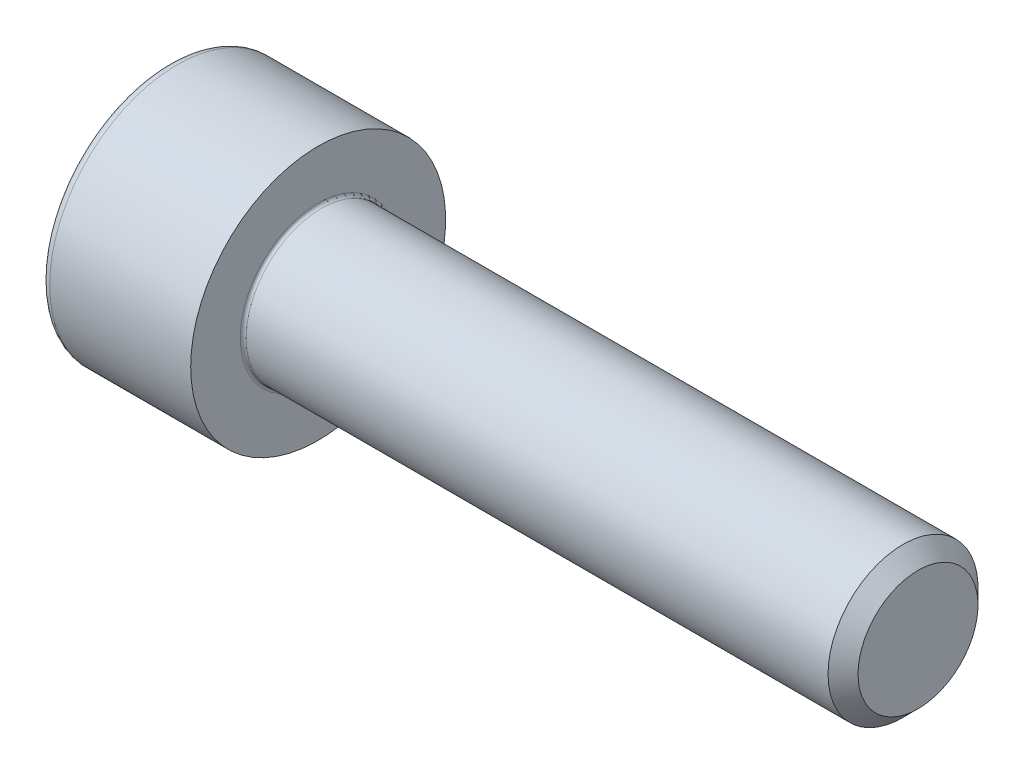
ISO-10303-21;
HEADER;
FILE_DESCRIPTION(('STEP AP214'),'2;1');
FILE_NAME('part.step','',(''),(''),'','','');
FILE_SCHEMA(('AUTOMOTIVE_DESIGN { 1 0 10303 214 1 1 1 1 }'));
ENDSEC;
DATA;
#1=APPLICATION_CONTEXT('core data for automotive mechanical design processes');
#2=APPLICATION_PROTOCOL_DEFINITION('international standard','automotive_design',2000,#1);
#3=PRODUCT_CONTEXT('',#1,'mechanical');
#4=PRODUCT('Part','Part','',(#3));
#5=PRODUCT_RELATED_PRODUCT_CATEGORY('part','',(#4));
#6=PRODUCT_DEFINITION_FORMATION('','',#4);
#7=PRODUCT_DEFINITION_CONTEXT('part definition',#1,'design');
#8=PRODUCT_DEFINITION('design','',#6,#7);
#9=PRODUCT_DEFINITION_SHAPE('','',#8);
#10=(LENGTH_UNIT() NAMED_UNIT(*) SI_UNIT(.MILLI.,.METRE.));
#11=(NAMED_UNIT(*) PLANE_ANGLE_UNIT() SI_UNIT($,.RADIAN.));
#12=(NAMED_UNIT(*) SI_UNIT($,.STERADIAN.) SOLID_ANGLE_UNIT());
#13=UNCERTAINTY_MEASURE_WITH_UNIT(LENGTH_MEASURE(1.E-05),#10,'distance_accuracy_value','');
#14=(GEOMETRIC_REPRESENTATION_CONTEXT(3) GLOBAL_UNCERTAINTY_ASSIGNED_CONTEXT((#13)) GLOBAL_UNIT_ASSIGNED_CONTEXT((#10,
#11,#12)) REPRESENTATION_CONTEXT('',''));
#15=CARTESIAN_POINT('',(0.,0.,0.));
#16=DIRECTION('',(0.,0.,1.));
#17=DIRECTION('',(1.,0.,0.));
#18=AXIS2_PLACEMENT_3D('',#15,#16,#17);
#19=CARTESIAN_POINT('',(0.,0.,0.));
#20=DIRECTION('',(-1.,0.,0.));
#21=DIRECTION('',(0.,0.,1.));
#22=AXIS2_PLACEMENT_3D('',#19,#20,#21);
#23=PLANE('',#22);
#24=DIRECTION('',(0.,-0.5,0.866025403784439));
#25=VECTOR('',#24,1.);
#26=CARTESIAN_POINT('',(0.,2.3094010767585,0.));
#27=LINE('',#26,#25);
#28=CARTESIAN_POINT('',(0.,2.3094010767585,0.));
#29=VERTEX_POINT('',#28);
#30=CARTESIAN_POINT('',(0.,1.15470053837925,2.));
#31=VERTEX_POINT('',#30);
#32=EDGE_CURVE('E258',#29,#31,#27,.T.);
#33=ORIENTED_EDGE('',*,*,#32,.T.);
#34=DIRECTION('',(0.,1.,0.));
#35=VECTOR('',#34,1.);
#36=CARTESIAN_POINT('',(0.,-1.15470053837926,2.));
#37=LINE('',#36,#35);
#38=CARTESIAN_POINT('',(0.,-1.15470053837926,2.));
#39=VERTEX_POINT('',#38);
#40=EDGE_CURVE('E130',#39,#31,#37,.T.);
#41=ORIENTED_EDGE('',*,*,#40,.F.);
#42=DIRECTION('',(0.,-0.500000000000001,-0.866025403784438));
#43=VECTOR('',#42,1.);
#44=CARTESIAN_POINT('',(0.,-1.15470053837926,2.));
#45=LINE('',#44,#43);
#46=CARTESIAN_POINT('',(0.,-2.30940107675851,0.));
#47=VERTEX_POINT('',#46);
#48=EDGE_CURVE('E261',#39,#47,#45,.T.);
#49=ORIENTED_EDGE('',*,*,#48,.T.);
#50=DIRECTION('',(0.,0.499999999999999,-0.866025403784439));
#51=VECTOR('',#50,1.);
#52=CARTESIAN_POINT('',(0.,-2.30940107675851,0.));
#53=LINE('',#52,#51);
#54=CARTESIAN_POINT('',(0.,-1.15470053837926,-2.));
#55=VERTEX_POINT('',#54);
#56=EDGE_CURVE('E264',#47,#55,#53,.T.);
#57=ORIENTED_EDGE('',*,*,#56,.T.);
#58=DIRECTION('',(0.,-1.,0.));
#59=VECTOR('',#58,1.);
#60=CARTESIAN_POINT('',(0.,1.15470053837924,-2.));
#61=LINE('',#60,#59);
#62=CARTESIAN_POINT('',(0.,1.15470053837924,-2.));
#63=VERTEX_POINT('',#62);
#64=EDGE_CURVE('E267',#63,#55,#61,.T.);
#65=ORIENTED_EDGE('',*,*,#64,.F.);
#66=DIRECTION('',(0.,-0.500000000000001,-0.866025403784438));
#67=VECTOR('',#66,1.);
#68=CARTESIAN_POINT('',(0.,2.3094010767585,0.));
#69=LINE('',#68,#67);
#70=EDGE_CURVE('E125',#29,#63,#69,.T.);
#71=ORIENTED_EDGE('',*,*,#70,.F.);
#72=EDGE_LOOP('',(#33,#41,#49,#57,#65,#71));
#73=FACE_BOUND('',#72,.T.);
#74=CARTESIAN_POINT('',(0.,0.,0.));
#75=DIRECTION('',(-1.,0.,0.));
#76=DIRECTION('',(0.,0.,1.));
#77=AXIS2_PLACEMENT_3D('',#74,#75,#76);
#78=CIRCLE('',#77,3.95);
#79=CARTESIAN_POINT('',(0.,0.,3.95));
#80=VERTEX_POINT('',#79);
#81=EDGE_CURVE('E42',#80,#80,#78,.T.);
#82=ORIENTED_EDGE('',*,*,#81,.T.);
#83=EDGE_LOOP('',(#82));
#84=FACE_BOUND('',#83,.T.);
#85=ADVANCED_FACE('F34',(#73,#84),#23,.T.);
#86=CARTESIAN_POINT('',(-31.75,0.,0.));
#87=DIRECTION('',(-1.,0.,0.));
#88=DIRECTION('',(0.,0.,1.));
#89=AXIS2_PLACEMENT_3D('',#86,#87,#88);
#90=CYLINDRICAL_SURFACE('',#89,4.25);
#91=CARTESIAN_POINT('',(0.300000000000002,0.,0.));
#92=DIRECTION('',(-1.,0.,0.));
#93=DIRECTION('',(0.,0.,1.));
#94=AXIS2_PLACEMENT_3D('',#91,#92,#93);
#95=CIRCLE('',#94,4.25);
#96=CARTESIAN_POINT('',(0.300000000000002,0.,4.25));
#97=VERTEX_POINT('',#96);
#98=EDGE_CURVE('E11',#97,#97,#95,.F.);
#99=ORIENTED_EDGE('',*,*,#98,.T.);
#100=EDGE_LOOP('',(#99));
#101=FACE_BOUND('',#100,.T.);
#102=CARTESIAN_POINT('',(5.,0.,0.));
#103=DIRECTION('',(-1.,0.,0.));
#104=DIRECTION('',(0.,0.,1.));
#105=AXIS2_PLACEMENT_3D('',#102,#103,#104);
#106=CIRCLE('',#105,4.25);
#107=CARTESIAN_POINT('',(5.,0.,4.25));
#108=VERTEX_POINT('',#107);
#109=EDGE_CURVE('E148',#108,#108,#106,.T.);
#110=ORIENTED_EDGE('',*,*,#109,.T.);
#111=EDGE_LOOP('',(#110));
#112=FACE_BOUND('',#111,.T.);
#113=ADVANCED_FACE('F172',(#101,#112),#90,.T.);
#114=CARTESIAN_POINT('',(5.,4.25,0.));
#115=DIRECTION('',(1.,0.,0.));
#116=DIRECTION('',(0.,0.,-1.));
#117=AXIS2_PLACEMENT_3D('',#114,#115,#116);
#118=PLANE('',#117);
#119=CARTESIAN_POINT('',(5.,0.,0.));
#120=DIRECTION('',(1.,0.,0.));
#121=DIRECTION('',(0.,0.,-1.));
#122=AXIS2_PLACEMENT_3D('',#119,#120,#121);
#123=CIRCLE('',#122,2.59999999999998);
#124=CARTESIAN_POINT('',(5.,0.,-2.59999999999998));
#125=VERTEX_POINT('',#124);
#126=EDGE_CURVE('E151',#125,#125,#123,.F.);
#127=ORIENTED_EDGE('',*,*,#126,.T.);
#128=EDGE_LOOP('',(#127));
#129=FACE_BOUND('',#128,.T.);
#130=ORIENTED_EDGE('',*,*,#109,.F.);
#131=EDGE_LOOP('',(#130));
#132=FACE_BOUND('',#131,.T.);
#133=ADVANCED_FACE('F178',(#129,#132),#118,.T.);
#134=CARTESIAN_POINT('',(-31.75,0.,0.));
#135=DIRECTION('',(-1.,0.,0.));
#136=DIRECTION('',(0.,0.,1.));
#137=AXIS2_PLACEMENT_3D('',#134,#135,#136);
#138=CYLINDRICAL_SURFACE('',#137,2.49999999999998);
#139=CARTESIAN_POINT('',(5.1,0.,0.));
#140=DIRECTION('',(1.,0.,0.));
#141=DIRECTION('',(0.,0.,-1.));
#142=AXIS2_PLACEMENT_3D('',#139,#140,#141);
#143=CIRCLE('',#142,2.49999999999998);
#144=CARTESIAN_POINT('',(5.1,0.,-2.49999999999998));
#145=VERTEX_POINT('',#144);
#146=EDGE_CURVE('E154',#145,#145,#143,.T.);
#147=ORIENTED_EDGE('',*,*,#146,.T.);
#148=EDGE_LOOP('',(#147));
#149=FACE_BOUND('',#148,.T.);
#150=CARTESIAN_POINT('',(24.5,0.,0.));
#151=DIRECTION('',(-1.,0.,0.));
#152=DIRECTION('',(0.,0.,1.));
#153=AXIS2_PLACEMENT_3D('',#150,#151,#152);
#154=CIRCLE('',#153,2.49999999999997);
#155=CARTESIAN_POINT('',(24.5,0.,2.49999999999997));
#156=VERTEX_POINT('',#155);
#157=EDGE_CURVE('E145',#156,#156,#154,.T.);
#158=ORIENTED_EDGE('',*,*,#157,.T.);
#159=EDGE_LOOP('',(#158));
#160=FACE_BOUND('',#159,.T.);
#161=ADVANCED_FACE('F184',(#149,#160),#138,.T.);
#162=CARTESIAN_POINT('',(25.,0.,0.));
#163=DIRECTION('',(-1.,0.,0.));
#164=DIRECTION('',(0.,0.,1.));
#165=AXIS2_PLACEMENT_3D('',#162,#163,#164);
#166=CONICAL_SURFACE('',#165,2.,0.785398163397387);
#167=ORIENTED_EDGE('',*,*,#157,.F.);
#168=EDGE_LOOP('',(#167));
#169=FACE_BOUND('',#168,.T.);
#170=CARTESIAN_POINT('',(25.,0.,0.));
#171=DIRECTION('',(-1.,0.,0.));
#172=DIRECTION('',(0.,0.,1.));
#173=AXIS2_PLACEMENT_3D('',#170,#171,#172);
#174=CIRCLE('',#173,2.);
#175=CARTESIAN_POINT('',(25.,0.,2.));
#176=VERTEX_POINT('',#175);
#177=EDGE_CURVE('E141',#176,#176,#174,.T.);
#178=ORIENTED_EDGE('',*,*,#177,.T.);
#179=EDGE_LOOP('',(#178));
#180=FACE_BOUND('',#179,.T.);
#181=ADVANCED_FACE('F188',(#169,#180),#166,.T.);
#182=CARTESIAN_POINT('',(25.,2.,0.));
#183=DIRECTION('',(1.,0.,0.));
#184=DIRECTION('',(0.,0.,-1.));
#185=AXIS2_PLACEMENT_3D('',#182,#183,#184);
#186=PLANE('',#185);
#187=ORIENTED_EDGE('',*,*,#177,.F.);
#188=EDGE_LOOP('',(#187));
#189=FACE_BOUND('',#188,.T.);
#190=ADVANCED_FACE('F168',(#189),#186,.T.);
#191=CARTESIAN_POINT('',(5.1,0.,0.));
#192=DIRECTION('',(1.,0.,0.));
#193=DIRECTION('',(0.,0.,-1.));
#194=AXIS2_PLACEMENT_3D('',#191,#192,#193);
#195=TOROIDAL_SURFACE('',#194,2.59999999999998,0.1);
#196=ORIENTED_EDGE('',*,*,#146,.F.);
#197=EDGE_LOOP('',(#196));
#198=FACE_BOUND('',#197,.T.);
#199=ORIENTED_EDGE('',*,*,#126,.F.);
#200=EDGE_LOOP('',(#199));
#201=FACE_BOUND('',#200,.T.);
#202=ADVANCED_FACE('F161',(#198,#201),#195,.F.);
#203=CARTESIAN_POINT('',(0.300000000000002,0.,0.));
#204=DIRECTION('',(-1.,0.,0.));
#205=DIRECTION('',(0.,0.,1.));
#206=AXIS2_PLACEMENT_3D('',#203,#204,#205);
#207=TOROIDAL_SURFACE('',#206,3.95,0.3);
#208=ORIENTED_EDGE('',*,*,#98,.F.);
#209=EDGE_LOOP('',(#208));
#210=FACE_BOUND('',#209,.T.);
#211=ORIENTED_EDGE('',*,*,#81,.F.);
#212=EDGE_LOOP('',(#211));
#213=FACE_BOUND('',#212,.T.);
#214=ADVANCED_FACE('F36',(#210,#213),#207,.T.);
#215=CARTESIAN_POINT('',(1.3,2.3094010767585,0.));
#216=DIRECTION('',(0.,-0.866025403784439,-0.5));
#217=DIRECTION('',(0.,0.5,-0.866025403784439));
#218=AXIS2_PLACEMENT_3D('',#215,#216,#217);
#219=PLANE('',#218);
#220=ORIENTED_EDGE('',*,*,#32,.F.);
#221=DIRECTION('',(-1.,0.,0.));
#222=VECTOR('',#221,1.);
#223=CARTESIAN_POINT('',(1.3,2.3094010767585,0.));
#224=LINE('',#223,#222);
#225=CARTESIAN_POINT('',(1.3,2.3094010767585,0.));
#226=VERTEX_POINT('',#225);
#227=EDGE_CURVE('E248',#226,#29,#224,.T.);
#228=ORIENTED_EDGE('',*,*,#227,.F.);
#229=DIRECTION('',(0.,-0.5,0.866025403784439));
#230=VECTOR('',#229,1.);
#231=CARTESIAN_POINT('',(1.3,2.3094010767585,0.));
#232=LINE('',#231,#230);
#233=CARTESIAN_POINT('',(1.3,1.73205080756887,0.999999999999997));
#234=VERTEX_POINT('',#233);
#235=EDGE_CURVE('E117',#226,#234,#232,.T.);
#236=ORIENTED_EDGE('',*,*,#235,.T.);
#237=CARTESIAN_POINT('',(1.3,1.15470053837925,2.));
#238=VERTEX_POINT('',#237);
#239=EDGE_CURVE('E108',#234,#238,#232,.T.);
#240=ORIENTED_EDGE('',*,*,#239,.T.);
#241=DIRECTION('',(-1.,0.,0.));
#242=VECTOR('',#241,1.);
#243=CARTESIAN_POINT('',(1.3,1.15470053837925,2.));
#244=LINE('',#243,#242);
#245=EDGE_CURVE('E122',#238,#31,#244,.T.);
#246=ORIENTED_EDGE('',*,*,#245,.T.);
#247=EDGE_LOOP('',(#220,#228,#236,#240,#246));
#248=FACE_BOUND('',#247,.T.);
#249=ADVANCED_FACE('F121',(#248),#219,.T.);
#250=CARTESIAN_POINT('',(1.3,-1.15470053837926,2.));
#251=DIRECTION('',(0.,0.,1.));
#252=DIRECTION('',(0.,-1.,0.));
#253=AXIS2_PLACEMENT_3D('',#250,#251,#252);
#254=PLANE('',#253);
#255=ORIENTED_EDGE('',*,*,#40,.T.);
#256=ORIENTED_EDGE('',*,*,#245,.F.);
#257=DIRECTION('',(0.,1.,0.));
#258=VECTOR('',#257,1.);
#259=CARTESIAN_POINT('',(1.3,-1.15470053837926,2.));
#260=LINE('',#259,#258);
#261=CARTESIAN_POINT('',(1.3,0.,2.));
#262=VERTEX_POINT('',#261);
#263=EDGE_CURVE('E105',#262,#238,#260,.T.);
#264=ORIENTED_EDGE('',*,*,#263,.F.);
#265=CARTESIAN_POINT('',(1.3,-1.15470053837926,2.));
#266=VERTEX_POINT('',#265);
#267=EDGE_CURVE('E116',#266,#262,#260,.T.);
#268=ORIENTED_EDGE('',*,*,#267,.F.);
#269=DIRECTION('',(-1.,0.,0.));
#270=VECTOR('',#269,1.);
#271=CARTESIAN_POINT('',(1.3,-1.15470053837926,2.));
#272=LINE('',#271,#270);
#273=EDGE_CURVE('E132',#266,#39,#272,.T.);
#274=ORIENTED_EDGE('',*,*,#273,.T.);
#275=EDGE_LOOP('',(#255,#256,#264,#268,#274));
#276=FACE_BOUND('',#275,.T.);
#277=ADVANCED_FACE('F127',(#276),#254,.F.);
#278=CARTESIAN_POINT('',(1.3,-1.15470053837926,2.));
#279=DIRECTION('',(0.,0.866025403784438,-0.500000000000001));
#280=DIRECTION('',(0.,0.500000000000001,0.866025403784438));
#281=AXIS2_PLACEMENT_3D('',#278,#279,#280);
#282=PLANE('',#281);
#283=ORIENTED_EDGE('',*,*,#48,.F.);
#284=ORIENTED_EDGE('',*,*,#273,.F.);
#285=DIRECTION('',(0.,-0.500000000000001,-0.866025403784438));
#286=VECTOR('',#285,1.);
#287=CARTESIAN_POINT('',(1.3,-1.15470053837926,2.));
#288=LINE('',#287,#286);
#289=CARTESIAN_POINT('',(1.3,-1.73205080756888,1.));
#290=VERTEX_POINT('',#289);
#291=EDGE_CURVE('E287',#266,#290,#288,.T.);
#292=ORIENTED_EDGE('',*,*,#291,.T.);
#293=CARTESIAN_POINT('',(1.3,-2.30940107675851,0.));
#294=VERTEX_POINT('',#293);
#295=EDGE_CURVE('E276',#290,#294,#288,.T.);
#296=ORIENTED_EDGE('',*,*,#295,.T.);
#297=DIRECTION('',(-1.,0.,0.));
#298=VECTOR('',#297,1.);
#299=CARTESIAN_POINT('',(1.3,-2.30940107675851,0.));
#300=LINE('',#299,#298);
#301=EDGE_CURVE('E137',#294,#47,#300,.T.);
#302=ORIENTED_EDGE('',*,*,#301,.T.);
#303=EDGE_LOOP('',(#283,#284,#292,#296,#302));
#304=FACE_BOUND('',#303,.T.);
#305=ADVANCED_FACE('F202',(#304),#282,.T.);
#306=CARTESIAN_POINT('',(1.3,-2.30940107675851,0.));
#307=DIRECTION('',(0.,0.866025403784439,0.499999999999999));
#308=DIRECTION('',(0.,-0.5,0.866025403784439));
#309=AXIS2_PLACEMENT_3D('',#306,#307,#308);
#310=PLANE('',#309);
#311=ORIENTED_EDGE('',*,*,#56,.F.);
#312=ORIENTED_EDGE('',*,*,#301,.F.);
#313=DIRECTION('',(0.,0.499999999999999,-0.866025403784439));
#314=VECTOR('',#313,1.);
#315=CARTESIAN_POINT('',(1.3,-2.30940107675851,0.));
#316=LINE('',#315,#314);
#317=CARTESIAN_POINT('',(1.3,-1.73205080756888,-1.));
#318=VERTEX_POINT('',#317);
#319=EDGE_CURVE('E254',#294,#318,#316,.T.);
#320=ORIENTED_EDGE('',*,*,#319,.T.);
#321=CARTESIAN_POINT('',(1.3,-1.15470053837926,-2.));
#322=VERTEX_POINT('',#321);
#323=EDGE_CURVE('E286',#318,#322,#316,.T.);
#324=ORIENTED_EDGE('',*,*,#323,.T.);
#325=DIRECTION('',(-1.,0.,0.));
#326=VECTOR('',#325,1.);
#327=CARTESIAN_POINT('',(1.3,-1.15470053837926,-2.));
#328=LINE('',#327,#326);
#329=EDGE_CURVE('E247',#322,#55,#328,.T.);
#330=ORIENTED_EDGE('',*,*,#329,.T.);
#331=EDGE_LOOP('',(#311,#312,#320,#324,#330));
#332=FACE_BOUND('',#331,.T.);
#333=ADVANCED_FACE('F205',(#332),#310,.T.);
#334=CARTESIAN_POINT('',(1.3,1.15470053837924,-2.));
#335=DIRECTION('',(0.,0.,-1.));
#336=DIRECTION('',(0.,1.,0.));
#337=AXIS2_PLACEMENT_3D('',#334,#335,#336);
#338=PLANE('',#337);
#339=ORIENTED_EDGE('',*,*,#64,.T.);
#340=ORIENTED_EDGE('',*,*,#329,.F.);
#341=DIRECTION('',(0.,-1.,0.));
#342=VECTOR('',#341,1.);
#343=CARTESIAN_POINT('',(1.3,1.15470053837924,-2.));
#344=LINE('',#343,#342);
#345=CARTESIAN_POINT('',(1.3,0.,-2.));
#346=VERTEX_POINT('',#345);
#347=EDGE_CURVE('E251',#346,#322,#344,.T.);
#348=ORIENTED_EDGE('',*,*,#347,.F.);
#349=CARTESIAN_POINT('',(1.3,1.15470053837924,-2.));
#350=VERTEX_POINT('',#349);
#351=EDGE_CURVE('E49',#350,#346,#344,.T.);
#352=ORIENTED_EDGE('',*,*,#351,.F.);
#353=DIRECTION('',(-1.,0.,0.));
#354=VECTOR('',#353,1.);
#355=CARTESIAN_POINT('',(1.3,1.15470053837924,-2.));
#356=LINE('',#355,#354);
#357=EDGE_CURVE('E244',#350,#63,#356,.T.);
#358=ORIENTED_EDGE('',*,*,#357,.T.);
#359=EDGE_LOOP('',(#339,#340,#348,#352,#358));
#360=FACE_BOUND('',#359,.T.);
#361=ADVANCED_FACE('F209',(#360),#338,.F.);
#362=CARTESIAN_POINT('',(1.3,2.3094010767585,0.));
#363=DIRECTION('',(0.,0.866025403784438,-0.500000000000001));
#364=DIRECTION('',(0.,0.500000000000001,0.866025403784438));
#365=AXIS2_PLACEMENT_3D('',#362,#363,#364);
#366=PLANE('',#365);
#367=ORIENTED_EDGE('',*,*,#70,.T.);
#368=ORIENTED_EDGE('',*,*,#357,.F.);
#369=DIRECTION('',(0.,-0.500000000000001,-0.866025403784438));
#370=VECTOR('',#369,1.);
#371=CARTESIAN_POINT('',(1.3,2.3094010767585,0.));
#372=LINE('',#371,#370);
#373=CARTESIAN_POINT('',(1.3,1.73205080756887,-1.));
#374=VERTEX_POINT('',#373);
#375=EDGE_CURVE('E234',#374,#350,#372,.T.);
#376=ORIENTED_EDGE('',*,*,#375,.F.);
#377=EDGE_CURVE('E240',#226,#374,#372,.T.);
#378=ORIENTED_EDGE('',*,*,#377,.F.);
#379=ORIENTED_EDGE('',*,*,#227,.T.);
#380=EDGE_LOOP('',(#367,#368,#376,#378,#379));
#381=FACE_BOUND('',#380,.T.);
#382=ADVANCED_FACE('F213',(#381),#366,.F.);
#383=CARTESIAN_POINT('',(1.3,2.3094010767585,0.));
#384=DIRECTION('',(1.,0.,0.));
#385=DIRECTION('',(0.,0.,-1.));
#386=AXIS2_PLACEMENT_3D('',#383,#384,#385);
#387=PLANE('',#386);
#388=ORIENTED_EDGE('',*,*,#347,.T.);
#389=ORIENTED_EDGE('',*,*,#323,.F.);
#390=CARTESIAN_POINT('',(1.3,0.,0.));
#391=DIRECTION('',(-1.,0.,0.));
#392=DIRECTION('',(0.,0.,1.));
#393=AXIS2_PLACEMENT_3D('',#390,#391,#392);
#394=CIRCLE('',#393,2.);
#395=EDGE_CURVE('E282',#346,#318,#394,.T.);
#396=ORIENTED_EDGE('',*,*,#395,.F.);
#397=EDGE_LOOP('',(#388,#389,#396));
#398=FACE_BOUND('',#397,.T.);
#399=ADVANCED_FACE('F217',(#398),#387,.F.);
#400=ORIENTED_EDGE('',*,*,#319,.F.);
#401=ORIENTED_EDGE('',*,*,#295,.F.);
#402=EDGE_CURVE('E135',#318,#290,#394,.T.);
#403=ORIENTED_EDGE('',*,*,#402,.F.);
#404=EDGE_LOOP('',(#400,#401,#403));
#405=FACE_BOUND('',#404,.T.);
#406=ADVANCED_FACE('F220',(#405),#387,.F.);
#407=ORIENTED_EDGE('',*,*,#291,.F.);
#408=ORIENTED_EDGE('',*,*,#267,.T.);
#409=EDGE_CURVE('E131',#290,#262,#394,.T.);
#410=ORIENTED_EDGE('',*,*,#409,.F.);
#411=EDGE_LOOP('',(#407,#408,#410));
#412=FACE_BOUND('',#411,.T.);
#413=ADVANCED_FACE('F225',(#412),#387,.F.);
#414=ORIENTED_EDGE('',*,*,#263,.T.);
#415=ORIENTED_EDGE('',*,*,#239,.F.);
#416=EDGE_CURVE('E111',#262,#234,#394,.T.);
#417=ORIENTED_EDGE('',*,*,#416,.F.);
#418=EDGE_LOOP('',(#414,#415,#417));
#419=FACE_BOUND('',#418,.T.);
#420=ADVANCED_FACE('F107',(#419),#387,.F.);
#421=ORIENTED_EDGE('',*,*,#235,.F.);
#422=ORIENTED_EDGE('',*,*,#377,.T.);
#423=EDGE_CURVE('E142',#234,#374,#394,.T.);
#424=ORIENTED_EDGE('',*,*,#423,.F.);
#425=EDGE_LOOP('',(#421,#422,#424));
#426=FACE_BOUND('',#425,.T.);
#427=ADVANCED_FACE('F228',(#426),#387,.F.);
#428=ORIENTED_EDGE('',*,*,#375,.T.);
#429=ORIENTED_EDGE('',*,*,#351,.T.);
#430=EDGE_CURVE('E237',#374,#346,#394,.T.);
#431=ORIENTED_EDGE('',*,*,#430,.F.);
#432=EDGE_LOOP('',(#428,#429,#431));
#433=FACE_BOUND('',#432,.T.);
#434=ADVANCED_FACE('F198',(#433),#387,.F.);
#435=CARTESIAN_POINT('',(1.3,0.,0.));
#436=DIRECTION('',(-1.,0.,0.));
#437=DIRECTION('',(0.,0.,1.));
#438=AXIS2_PLACEMENT_3D('',#435,#436,#437);
#439=CONICAL_SURFACE('',#438,2.,1.04719755119659);
#440=CARTESIAN_POINT('',(2.45470053837926,0.,0.));
#441=VERTEX_POINT('',#440);
#442=VERTEX_LOOP('',#441);
#443=FACE_BOUND('',#442,.T.);
#444=ORIENTED_EDGE('',*,*,#416,.T.);
#445=ORIENTED_EDGE('',*,*,#423,.T.);
#446=ORIENTED_EDGE('',*,*,#430,.T.);
#447=ORIENTED_EDGE('',*,*,#395,.T.);
#448=ORIENTED_EDGE('',*,*,#402,.T.);
#449=ORIENTED_EDGE('',*,*,#409,.T.);
#450=EDGE_LOOP('',(#444,#445,#446,#447,#448,#449));
#451=FACE_BOUND('',#450,.T.);
#452=ADVANCED_FACE('F196',(#443,#451),#439,.F.);
#453=CLOSED_SHELL('',(#85,#113,#133,#161,#181,#190,#202,#214,#249,#277,#305,#333,#361,#382,#399,
#406,#413,#420,#427,#434,#452));
#454=MANIFOLD_SOLID_BREP('B2',#453);
#455=ADVANCED_BREP_SHAPE_REPRESENTATION('',(#18,#454),#14);
#456=SHAPE_DEFINITION_REPRESENTATION(#9,#455);
ENDSEC;
END-ISO-10303-21;
